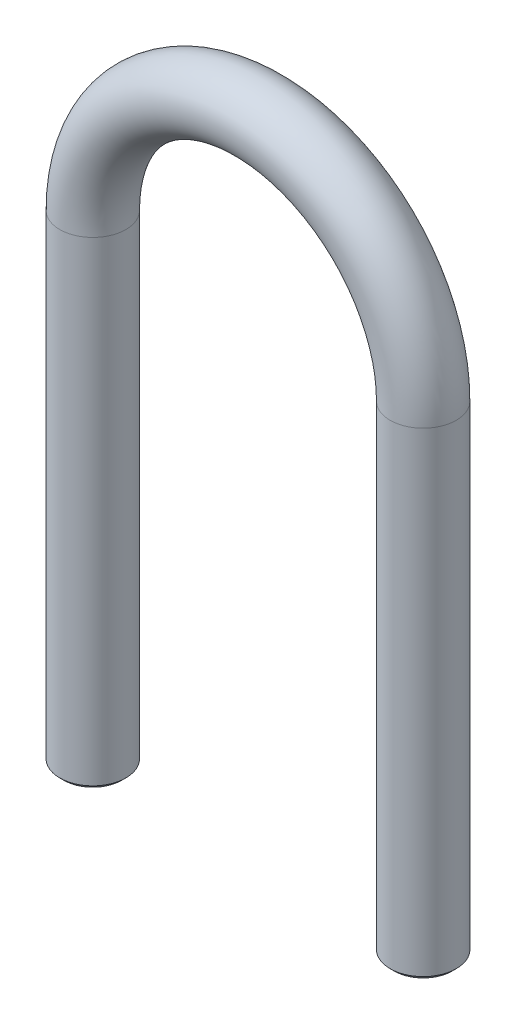
ISO-10303-21;
HEADER;
FILE_DESCRIPTION(('STEP AP214'),'2;1');
FILE_NAME('part.step','',(''),(''),'','','');
FILE_SCHEMA(('AUTOMOTIVE_DESIGN { 1 0 10303 214 1 1 1 1 }'));
ENDSEC;
DATA;
#1=APPLICATION_CONTEXT('core data for automotive mechanical design processes');
#2=APPLICATION_PROTOCOL_DEFINITION('international standard','automotive_design',2000,#1);
#3=PRODUCT_CONTEXT('',#1,'mechanical');
#4=PRODUCT('Part','Part','',(#3));
#5=PRODUCT_RELATED_PRODUCT_CATEGORY('part','',(#4));
#6=PRODUCT_DEFINITION_FORMATION('','',#4);
#7=PRODUCT_DEFINITION_CONTEXT('part definition',#1,'design');
#8=PRODUCT_DEFINITION('design','',#6,#7);
#9=PRODUCT_DEFINITION_SHAPE('','',#8);
#10=(LENGTH_UNIT() NAMED_UNIT(*) SI_UNIT(.MILLI.,.METRE.));
#11=(NAMED_UNIT(*) PLANE_ANGLE_UNIT() SI_UNIT($,.RADIAN.));
#12=(NAMED_UNIT(*) SI_UNIT($,.STERADIAN.) SOLID_ANGLE_UNIT());
#13=UNCERTAINTY_MEASURE_WITH_UNIT(LENGTH_MEASURE(1.E-05),#10,'distance_accuracy_value','');
#14=(GEOMETRIC_REPRESENTATION_CONTEXT(3) GLOBAL_UNCERTAINTY_ASSIGNED_CONTEXT((#13)) GLOBAL_UNIT_ASSIGNED_CONTEXT((#10,
#11,#12)) REPRESENTATION_CONTEXT('',''));
#15=CARTESIAN_POINT('',(0.,0.,0.));
#16=DIRECTION('',(0.,0.,1.));
#17=DIRECTION('',(1.,0.,0.));
#18=AXIS2_PLACEMENT_3D('',#15,#16,#17);
#19=CARTESIAN_POINT('',(20.,0.,0.));
#20=DIRECTION('',(0.,-1.,0.));
#21=DIRECTION('',(1.,0.,0.));
#22=AXIS2_PLACEMENT_3D('',#19,#20,#21);
#23=CYLINDRICAL_SURFACE('',#22,4.);
#24=CARTESIAN_POINT('',(20.,-57.5,0.));
#25=DIRECTION('',(0.,-1.,0.));
#26=DIRECTION('',(0.,0.,-1.));
#27=AXIS2_PLACEMENT_3D('',#24,#25,#26);
#28=CIRCLE('',#27,4.);
#29=CARTESIAN_POINT('',(20.,-57.5,-4.));
#30=VERTEX_POINT('',#29);
#31=EDGE_CURVE('E43',#30,#30,#28,.F.);
#32=ORIENTED_EDGE('',*,*,#31,.T.);
#33=EDGE_LOOP('',(#32));
#34=FACE_BOUND('',#33,.T.);
#35=CARTESIAN_POINT('',(20.,0.,0.));
#36=DIRECTION('',(0.,-1.,0.));
#37=DIRECTION('',(0.,0.,1.));
#38=AXIS2_PLACEMENT_3D('',#35,#36,#37);
#39=CIRCLE('',#38,4.);
#40=CARTESIAN_POINT('',(24.,0.,0.));
#41=VERTEX_POINT('',#40);
#42=EDGE_CURVE('E52',#41,#41,#39,.T.);
#43=ORIENTED_EDGE('',*,*,#42,.T.);
#44=EDGE_LOOP('',(#43));
#45=FACE_BOUND('',#44,.T.);
#46=ADVANCED_FACE('F32',(#34,#45),#23,.T.);
#47=CARTESIAN_POINT('',(0.,0.,0.));
#48=DIRECTION('',(0.,0.,-1.));
#49=DIRECTION('',(-1.,0.,0.));
#50=AXIS2_PLACEMENT_3D('',#47,#48,#49);
#51=TOROIDAL_SURFACE('',#50,20.,4.);
#52=CARTESIAN_POINT('',(-20.,0.,0.));
#53=DIRECTION('',(0.,1.,0.));
#54=DIRECTION('',(0.,0.,1.));
#55=AXIS2_PLACEMENT_3D('',#52,#53,#54);
#56=CIRCLE('',#55,4.);
#57=CARTESIAN_POINT('',(-24.,0.,0.));
#58=VERTEX_POINT('',#57);
#59=EDGE_CURVE('E55',#58,#58,#56,.T.);
#60=CARTESIAN_POINT('',(0.,0.,0.));
#61=DIRECTION('',(0.,0.,-1.));
#62=DIRECTION('',(-1.,0.,0.));
#63=AXIS2_PLACEMENT_3D('',#60,#61,#62);
#64=CIRCLE('',#63,24.);
#65=EDGE_CURVE('',#58,#41,#64,.T.);
#66=ORIENTED_EDGE('',*,*,#59,.T.);
#67=ORIENTED_EDGE('',*,*,#42,.F.);
#68=ORIENTED_EDGE('',*,*,#65,.T.);
#69=ORIENTED_EDGE('',*,*,#65,.F.);
#70=EDGE_LOOP('',(#66,#68,#67,#69));
#71=FACE_BOUND('',#70,.T.);
#72=ADVANCED_FACE('F59',(#71),#51,.T.);
#73=CARTESIAN_POINT('',(-20.,0.,0.));
#74=DIRECTION('',(0.,-1.,0.));
#75=DIRECTION('',(1.,0.,0.));
#76=AXIS2_PLACEMENT_3D('',#73,#74,#75);
#77=CYLINDRICAL_SURFACE('',#76,4.);
#78=CARTESIAN_POINT('',(-20.,-57.4999999999999,0.));
#79=DIRECTION('',(0.,1.,0.));
#80=DIRECTION('',(0.,0.,1.));
#81=AXIS2_PLACEMENT_3D('',#78,#79,#80);
#82=CIRCLE('',#81,4.);
#83=CARTESIAN_POINT('',(-20.,-57.4999999999999,4.));
#84=VERTEX_POINT('',#83);
#85=EDGE_CURVE('E39',#84,#84,#82,.T.);
#86=ORIENTED_EDGE('',*,*,#85,.T.);
#87=EDGE_LOOP('',(#86));
#88=FACE_BOUND('',#87,.T.);
#89=ORIENTED_EDGE('',*,*,#59,.F.);
#90=EDGE_LOOP('',(#89));
#91=FACE_BOUND('',#90,.T.);
#92=ADVANCED_FACE('F62',(#88,#91),#77,.T.);
#93=CARTESIAN_POINT('',(20.,-58.,0.));
#94=DIRECTION('',(0.,-1.,0.));
#95=DIRECTION('',(0.,0.,1.));
#96=AXIS2_PLACEMENT_3D('',#93,#94,#95);
#97=PLANE('',#96);
#98=CARTESIAN_POINT('',(20.,-58.,0.));
#99=DIRECTION('',(0.,-1.,0.));
#100=DIRECTION('',(1.,0.,0.));
#101=AXIS2_PLACEMENT_3D('',#98,#99,#100);
#102=CIRCLE('',#101,3.50000000000003);
#103=CARTESIAN_POINT('',(23.5,-58.,0.));
#104=VERTEX_POINT('',#103);
#105=EDGE_CURVE('E47',#104,#104,#102,.T.);
#106=ORIENTED_EDGE('',*,*,#105,.T.);
#107=EDGE_LOOP('',(#106));
#108=FACE_BOUND('',#107,.T.);
#109=ADVANCED_FACE('F64',(#108),#97,.T.);
#110=CARTESIAN_POINT('',(-20.,-58.,0.));
#111=DIRECTION('',(0.,1.,0.));
#112=DIRECTION('',(0.,0.,1.));
#113=AXIS2_PLACEMENT_3D('',#110,#111,#112);
#114=PLANE('',#113);
#115=CARTESIAN_POINT('',(-20.,-58.,0.));
#116=DIRECTION('',(0.,1.,0.));
#117=DIRECTION('',(0.,0.,1.));
#118=AXIS2_PLACEMENT_3D('',#115,#116,#117);
#119=CIRCLE('',#118,3.49999999999993);
#120=CARTESIAN_POINT('',(-20.,-58.,3.49999999999993));
#121=VERTEX_POINT('',#120);
#122=EDGE_CURVE('E10',#121,#121,#119,.F.);
#123=ORIENTED_EDGE('',*,*,#122,.T.);
#124=EDGE_LOOP('',(#123));
#125=FACE_BOUND('',#124,.T.);
#126=ADVANCED_FACE('F70',(#125),#114,.F.);
#127=CARTESIAN_POINT('',(20.,-58.,0.));
#128=DIRECTION('',(0.,1.,0.));
#129=DIRECTION('',(0.,0.,1.));
#130=AXIS2_PLACEMENT_3D('',#127,#128,#129);
#131=CONICAL_SURFACE('',#130,3.50000000000003,0.785398163397452);
#132=ORIENTED_EDGE('',*,*,#31,.F.);
#133=EDGE_LOOP('',(#132));
#134=FACE_BOUND('',#133,.T.);
#135=ORIENTED_EDGE('',*,*,#105,.F.);
#136=EDGE_LOOP('',(#135));
#137=FACE_BOUND('',#136,.T.);
#138=ADVANCED_FACE('F81',(#134,#137),#131,.T.);
#139=CARTESIAN_POINT('',(-20.,-57.4999999999999,0.));
#140=DIRECTION('',(0.,1.,0.));
#141=DIRECTION('',(0.,0.,1.));
#142=AXIS2_PLACEMENT_3D('',#139,#140,#141);
#143=CONICAL_SURFACE('',#142,4.,0.785398163397445);
#144=ORIENTED_EDGE('',*,*,#122,.F.);
#145=EDGE_LOOP('',(#144));
#146=FACE_BOUND('',#145,.T.);
#147=ORIENTED_EDGE('',*,*,#85,.F.);
#148=EDGE_LOOP('',(#147));
#149=FACE_BOUND('',#148,.T.);
#150=ADVANCED_FACE('F34',(#146,#149),#143,.T.);
#151=CLOSED_SHELL('',(#46,#72,#92,#109,#126,#138,#150));
#152=MANIFOLD_SOLID_BREP('B2',#151);
#153=ADVANCED_BREP_SHAPE_REPRESENTATION('',(#18,#152),#14);
#154=SHAPE_DEFINITION_REPRESENTATION(#9,#153);
ENDSEC;
END-ISO-10303-21;
